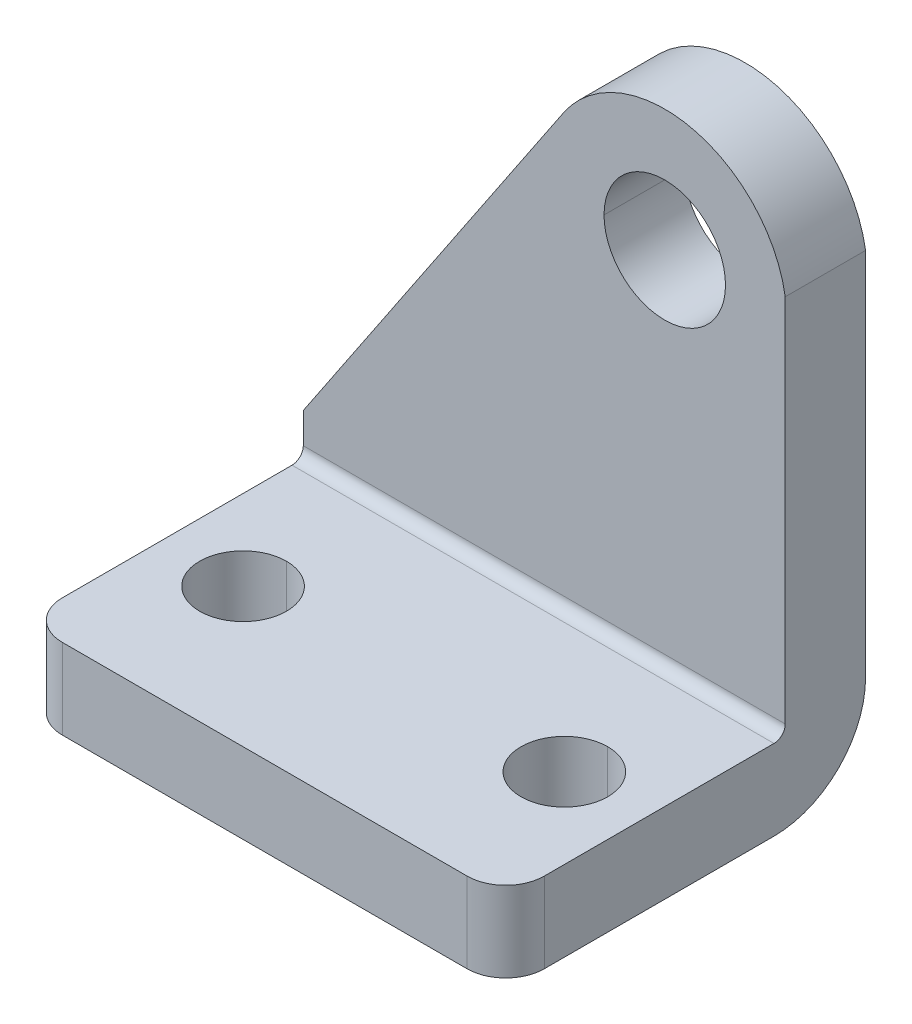
ISO-10303-21;
HEADER;
FILE_DESCRIPTION(('STEP AP214'),'2;1');
FILE_NAME('part.step','',(''),(''),'','','');
FILE_SCHEMA(('AUTOMOTIVE_DESIGN { 1 0 10303 214 1 1 1 1 }'));
ENDSEC;
DATA;
#1=APPLICATION_CONTEXT('core data for automotive mechanical design processes');
#2=APPLICATION_PROTOCOL_DEFINITION('international standard','automotive_design',2000,#1);
#3=PRODUCT_CONTEXT('',#1,'mechanical');
#4=PRODUCT('Part','Part','',(#3));
#5=PRODUCT_RELATED_PRODUCT_CATEGORY('part','',(#4));
#6=PRODUCT_DEFINITION_FORMATION('','',#4);
#7=PRODUCT_DEFINITION_CONTEXT('part definition',#1,'design');
#8=PRODUCT_DEFINITION('design','',#6,#7);
#9=PRODUCT_DEFINITION_SHAPE('','',#8);
#10=(LENGTH_UNIT() NAMED_UNIT(*) SI_UNIT(.MILLI.,.METRE.));
#11=(NAMED_UNIT(*) PLANE_ANGLE_UNIT() SI_UNIT($,.RADIAN.));
#12=(NAMED_UNIT(*) SI_UNIT($,.STERADIAN.) SOLID_ANGLE_UNIT());
#13=UNCERTAINTY_MEASURE_WITH_UNIT(LENGTH_MEASURE(1.E-05),#10,'distance_accuracy_value','');
#14=(GEOMETRIC_REPRESENTATION_CONTEXT(3) GLOBAL_UNCERTAINTY_ASSIGNED_CONTEXT((#13)) GLOBAL_UNIT_ASSIGNED_CONTEXT((#10,
#11,#12)) REPRESENTATION_CONTEXT('',''));
#15=CARTESIAN_POINT('',(0.,0.,0.));
#16=DIRECTION('',(0.,0.,1.));
#17=DIRECTION('',(1.,0.,0.));
#18=AXIS2_PLACEMENT_3D('',#15,#16,#17);
#19=CARTESIAN_POINT('',(35.0520000000013,6.35,25.4000000000013));
#20=DIRECTION('',(0.,1.,0.));
#21=DIRECTION('',(-0.707106781186546,0.,-0.707106781186549));
#22=AXIS2_PLACEMENT_3D('',#19,#20,#21);
#23=CYLINDRICAL_SURFACE('',#22,3.048);
#24=CARTESIAN_POINT('',(35.0520000000013,0.,25.4000000000013));
#25=DIRECTION('',(0.,1.,0.));
#26=DIRECTION('',(1.,0.,0.));
#27=AXIS2_PLACEMENT_3D('',#24,#25,#26);
#28=CIRCLE('',#27,3.048);
#29=CARTESIAN_POINT('',(35.052,0.,28.448));
#30=VERTEX_POINT('',#29);
#31=CARTESIAN_POINT('',(38.1,0.,25.4000000000013));
#32=VERTEX_POINT('',#31);
#33=EDGE_CURVE('E10',#30,#32,#28,.T.);
#34=ORIENTED_EDGE('',*,*,#33,.T.);
#35=DIRECTION('',(0.,-1.,0.));
#36=VECTOR('',#35,1.);
#37=CARTESIAN_POINT('',(38.1,6.35,25.4));
#38=LINE('',#37,#36);
#39=CARTESIAN_POINT('',(38.1,6.35,25.4));
#40=VERTEX_POINT('',#39);
#41=EDGE_CURVE('E24',#40,#32,#38,.T.);
#42=ORIENTED_EDGE('',*,*,#41,.F.);
#43=CARTESIAN_POINT('',(35.0520000000013,6.35,25.4000000000013));
#44=DIRECTION('',(0.,1.,0.));
#45=DIRECTION('',(1.,0.,0.));
#46=AXIS2_PLACEMENT_3D('',#43,#44,#45);
#47=CIRCLE('',#46,3.048);
#48=CARTESIAN_POINT('',(35.052,6.35,28.448));
#49=VERTEX_POINT('',#48);
#50=EDGE_CURVE('E339',#49,#40,#47,.T.);
#51=ORIENTED_EDGE('',*,*,#50,.F.);
#52=DIRECTION('',(0.,-1.,0.));
#53=VECTOR('',#52,1.);
#54=CARTESIAN_POINT('',(35.052,6.35,28.448));
#55=LINE('',#54,#53);
#56=EDGE_CURVE('E335',#49,#30,#55,.T.);
#57=ORIENTED_EDGE('',*,*,#56,.T.);
#58=EDGE_LOOP('',(#34,#42,#51,#57));
#59=FACE_BOUND('',#58,.T.);
#60=ADVANCED_FACE('F16',(#59),#23,.T.);
#61=CARTESIAN_POINT('',(38.1,6.35,28.448));
#62=DIRECTION('',(0.,0.,-1.));
#63=DIRECTION('',(-1.,0.,0.));
#64=AXIS2_PLACEMENT_3D('',#61,#62,#63);
#65=PLANE('',#64);
#66=DIRECTION('',(-1.,0.,0.));
#67=VECTOR('',#66,1.);
#68=CARTESIAN_POINT('',(38.1,0.,28.448));
#69=LINE('',#68,#67);
#70=CARTESIAN_POINT('',(3.048,0.,28.448));
#71=VERTEX_POINT('',#70);
#72=EDGE_CURVE('E330',#30,#71,#69,.T.);
#73=ORIENTED_EDGE('',*,*,#72,.F.);
#74=ORIENTED_EDGE('',*,*,#56,.F.);
#75=DIRECTION('',(-1.,0.,0.));
#76=VECTOR('',#75,1.);
#77=CARTESIAN_POINT('',(38.1,6.35,28.448));
#78=LINE('',#77,#76);
#79=CARTESIAN_POINT('',(3.048,6.35,28.448));
#80=VERTEX_POINT('',#79);
#81=EDGE_CURVE('E326',#49,#80,#78,.T.);
#82=ORIENTED_EDGE('',*,*,#81,.T.);
#83=DIRECTION('',(0.,-1.,0.));
#84=VECTOR('',#83,1.);
#85=CARTESIAN_POINT('',(3.048,6.35,28.448));
#86=LINE('',#85,#84);
#87=EDGE_CURVE('E322',#80,#71,#86,.T.);
#88=ORIENTED_EDGE('',*,*,#87,.T.);
#89=EDGE_LOOP('',(#73,#74,#82,#88));
#90=FACE_BOUND('',#89,.T.);
#91=ADVANCED_FACE('F421',(#90),#65,.F.);
#92=CARTESIAN_POINT('',(3.04799999999929,6.35,25.4000000000008));
#93=DIRECTION('',(0.,1.,0.));
#94=DIRECTION('',(0.707106781186553,0.,-0.707106781186542));
#95=AXIS2_PLACEMENT_3D('',#92,#93,#94);
#96=CYLINDRICAL_SURFACE('',#95,3.048);
#97=CARTESIAN_POINT('',(3.04799999999929,0.,25.4000000000008));
#98=DIRECTION('',(0.,1.,0.));
#99=DIRECTION('',(1.,0.,0.));
#100=AXIS2_PLACEMENT_3D('',#97,#98,#99);
#101=CIRCLE('',#100,3.048);
#102=CARTESIAN_POINT('',(0.,0.,25.4000000000008));
#103=VERTEX_POINT('',#102);
#104=EDGE_CURVE('E317',#103,#71,#101,.T.);
#105=ORIENTED_EDGE('',*,*,#104,.T.);
#106=ORIENTED_EDGE('',*,*,#87,.F.);
#107=CARTESIAN_POINT('',(3.04799999999929,6.35,25.4000000000008));
#108=DIRECTION('',(0.,1.,0.));
#109=DIRECTION('',(1.,0.,0.));
#110=AXIS2_PLACEMENT_3D('',#107,#108,#109);
#111=CIRCLE('',#110,3.048);
#112=CARTESIAN_POINT('',(0.,6.35,25.4));
#113=VERTEX_POINT('',#112);
#114=EDGE_CURVE('E312',#113,#80,#111,.T.);
#115=ORIENTED_EDGE('',*,*,#114,.F.);
#116=DIRECTION('',(0.,-1.,0.));
#117=VECTOR('',#116,1.);
#118=CARTESIAN_POINT('',(0.,6.35,25.4));
#119=LINE('',#118,#117);
#120=EDGE_CURVE('E308',#113,#103,#119,.T.);
#121=ORIENTED_EDGE('',*,*,#120,.T.);
#122=EDGE_LOOP('',(#105,#106,#115,#121));
#123=FACE_BOUND('',#122,.T.);
#124=ADVANCED_FACE('F418',(#123),#96,.T.);
#125=CARTESIAN_POINT('',(0.,7.23900000000005,7.23900000000005));
#126=DIRECTION('',(1.,0.,0.));
#127=DIRECTION('',(0.,0.,-1.));
#128=AXIS2_PLACEMENT_3D('',#125,#126,#127);
#129=PLANE('',#128);
#130=DIRECTION('',(0.,1.,0.));
#131=VECTOR('',#130,1.);
#132=CARTESIAN_POINT('',(0.,7.239,0.));
#133=LINE('',#132,#131);
#134=CARTESIAN_POINT('',(0.,7.239,0.));
#135=VERTEX_POINT('',#134);
#136=CARTESIAN_POINT('',(0.,9.652,0.));
#137=VERTEX_POINT('',#136);
#138=EDGE_CURVE('E303',#135,#137,#133,.T.);
#139=ORIENTED_EDGE('',*,*,#138,.F.);
#140=CARTESIAN_POINT('',(0.,7.23900000000005,7.23900000000005));
#141=DIRECTION('',(1.,0.,0.));
#142=DIRECTION('',(0.,0.,-1.));
#143=AXIS2_PLACEMENT_3D('',#140,#141,#142);
#144=CIRCLE('',#143,7.239);
#145=CARTESIAN_POINT('',(0.,0.,7.239));
#146=VERTEX_POINT('',#145);
#147=EDGE_CURVE('E298',#146,#135,#144,.T.);
#148=ORIENTED_EDGE('',*,*,#147,.F.);
#149=DIRECTION('',(0.,0.,-1.));
#150=VECTOR('',#149,1.);
#151=CARTESIAN_POINT('',(0.,0.,28.448));
#152=LINE('',#151,#150);
#153=EDGE_CURVE('E293',#103,#146,#152,.T.);
#154=ORIENTED_EDGE('',*,*,#153,.F.);
#155=ORIENTED_EDGE('',*,*,#120,.F.);
#156=DIRECTION('',(0.,0.,1.));
#157=VECTOR('',#156,1.);
#158=CARTESIAN_POINT('',(0.,6.35,7.239));
#159=LINE('',#158,#157);
#160=CARTESIAN_POINT('',(0.,6.35,7.239));
#161=VERTEX_POINT('',#160);
#162=EDGE_CURVE('E288',#161,#113,#159,.T.);
#163=ORIENTED_EDGE('',*,*,#162,.F.);
#164=CARTESIAN_POINT('',(0.,7.23900000000015,7.23900000000015));
#165=DIRECTION('',(1.,0.,0.));
#166=DIRECTION('',(0.,0.,-1.));
#167=AXIS2_PLACEMENT_3D('',#164,#165,#166);
#168=CIRCLE('',#167,0.889);
#169=CARTESIAN_POINT('',(0.,7.239,6.35));
#170=VERTEX_POINT('',#169);
#171=EDGE_CURVE('E284',#161,#170,#168,.T.);
#172=ORIENTED_EDGE('',*,*,#171,.T.);
#173=DIRECTION('',(0.,-1.,0.));
#174=VECTOR('',#173,1.);
#175=CARTESIAN_POINT('',(0.,45.72,6.35));
#176=LINE('',#175,#174);
#177=CARTESIAN_POINT('',(0.,9.652,6.35));
#178=VERTEX_POINT('',#177);
#179=EDGE_CURVE('E279',#178,#170,#176,.T.);
#180=ORIENTED_EDGE('',*,*,#179,.F.);
#181=DIRECTION('',(0.,0.,-1.));
#182=VECTOR('',#181,1.);
#183=CARTESIAN_POINT('',(0.,9.652,6.35));
#184=LINE('',#183,#182);
#185=EDGE_CURVE('E275',#178,#137,#184,.T.);
#186=ORIENTED_EDGE('',*,*,#185,.T.);
#187=EDGE_LOOP('',(#139,#148,#154,#155,#163,#172,#180,#186));
#188=FACE_BOUND('',#187,.T.);
#189=ADVANCED_FACE('F413',(#188),#129,.F.);
#190=CARTESIAN_POINT('',(0.,9.652,6.35));
#191=DIRECTION('',(-0.830469726300041,0.557063760891996,0.));
#192=DIRECTION('',(-0.557063760891996,-0.830469726300041,0.));
#193=AXIS2_PLACEMENT_3D('',#190,#191,#192);
#194=PLANE('',#193);
#195=DIRECTION('',(0.557063760891996,0.830469726300041,0.));
#196=VECTOR('',#195,1.);
#197=CARTESIAN_POINT('',(0.,9.652,0.));
#198=LINE('',#197,#196);
#199=CARTESIAN_POINT('',(20.559306201752,40.3017794201301,0.));
#200=VERTEX_POINT('',#199);
#201=EDGE_CURVE('E270',#137,#200,#198,.T.);
#202=ORIENTED_EDGE('',*,*,#201,.F.);
#203=ORIENTED_EDGE('',*,*,#185,.F.);
#204=DIRECTION('',(0.557063760891996,0.830469726300041,0.));
#205=VECTOR('',#204,1.);
#206=CARTESIAN_POINT('',(0.,9.652,6.35));
#207=LINE('',#206,#205);
#208=CARTESIAN_POINT('',(20.559306201752,40.3017794201301,6.35));
#209=VERTEX_POINT('',#208);
#210=EDGE_CURVE('E266',#178,#209,#207,.T.);
#211=ORIENTED_EDGE('',*,*,#210,.T.);
#212=DIRECTION('',(0.,0.,-1.));
#213=VECTOR('',#212,1.);
#214=CARTESIAN_POINT('',(20.559306201752,40.3017794201301,6.35));
#215=LINE('',#214,#213);
#216=EDGE_CURVE('E262',#209,#200,#215,.T.);
#217=ORIENTED_EDGE('',*,*,#216,.T.);
#218=EDGE_LOOP('',(#202,#203,#211,#217));
#219=FACE_BOUND('',#218,.T.);
#220=ADVANCED_FACE('F411',(#219),#194,.T.);
#221=CARTESIAN_POINT('',(28.5749999999997,34.9249999999997,6.35));
#222=DIRECTION('',(0.,0.,1.));
#223=DIRECTION('',(-0.212588316482745,-0.977141856485041,0.));
#224=AXIS2_PLACEMENT_3D('',#221,#222,#223);
#225=CYLINDRICAL_SURFACE('',#224,9.652);
#226=DIRECTION('',(0.,0.,-1.));
#227=VECTOR('',#226,1.);
#228=CARTESIAN_POINT('',(38.1,36.4856021273851,6.35));
#229=LINE('',#228,#227);
#230=CARTESIAN_POINT('',(38.1,36.4856021273851,6.35));
#231=VERTEX_POINT('',#230);
#232=CARTESIAN_POINT('',(38.1,36.4856021273851,0.));
#233=VERTEX_POINT('',#232);
#234=EDGE_CURVE('E258',#231,#233,#229,.T.);
#235=ORIENTED_EDGE('',*,*,#234,.T.);
#236=CARTESIAN_POINT('',(28.5749999999997,34.9249999999997,0.));
#237=DIRECTION('',(0.,0.,1.));
#238=DIRECTION('',(1.,0.,0.));
#239=AXIS2_PLACEMENT_3D('',#236,#237,#238);
#240=CIRCLE('',#239,9.652);
#241=EDGE_CURVE('E253',#233,#200,#240,.T.);
#242=ORIENTED_EDGE('',*,*,#241,.T.);
#243=ORIENTED_EDGE('',*,*,#216,.F.);
#244=CARTESIAN_POINT('',(28.5749999999997,34.9249999999997,6.35));
#245=DIRECTION('',(0.,0.,1.));
#246=DIRECTION('',(1.,0.,0.));
#247=AXIS2_PLACEMENT_3D('',#244,#245,#246);
#248=CIRCLE('',#247,9.652);
#249=EDGE_CURVE('E248',#231,#209,#248,.T.);
#250=ORIENTED_EDGE('',*,*,#249,.F.);
#251=EDGE_LOOP('',(#235,#242,#243,#250));
#252=FACE_BOUND('',#251,.T.);
#253=ADVANCED_FACE('F369',(#252),#225,.T.);
#254=CARTESIAN_POINT('',(38.1,45.72,6.35));
#255=DIRECTION('',(0.,0.,-1.));
#256=DIRECTION('',(-1.,0.,0.));
#257=AXIS2_PLACEMENT_3D('',#254,#255,#256);
#258=PLANE('',#257);
#259=CARTESIAN_POINT('',(28.575,34.925,6.35));
#260=DIRECTION('',(0.,0.,-1.));
#261=DIRECTION('',(-1.,0.,0.));
#262=AXIS2_PLACEMENT_3D('',#259,#260,#261);
#263=CIRCLE('',#262,4.8006);
#264=CARTESIAN_POINT('',(23.7744,34.925,6.35));
#265=VERTEX_POINT('',#264);
#266=CARTESIAN_POINT('',(33.3756,34.925,6.35));
#267=VERTEX_POINT('',#266);
#268=EDGE_CURVE('E244',#265,#267,#263,.T.);
#269=ORIENTED_EDGE('',*,*,#268,.T.);
#270=CARTESIAN_POINT('',(28.575,34.925,6.35));
#271=DIRECTION('',(0.,0.,-1.));
#272=DIRECTION('',(-1.,0.,0.));
#273=AXIS2_PLACEMENT_3D('',#270,#271,#272);
#274=CIRCLE('',#273,4.8006);
#275=EDGE_CURVE('E240',#267,#265,#274,.T.);
#276=ORIENTED_EDGE('',*,*,#275,.T.);
#277=EDGE_LOOP('',(#269,#276));
#278=FACE_BOUND('',#277,.T.);
#279=ORIENTED_EDGE('',*,*,#210,.F.);
#280=ORIENTED_EDGE('',*,*,#179,.T.);
#281=DIRECTION('',(-1.,0.,0.));
#282=VECTOR('',#281,1.);
#283=CARTESIAN_POINT('',(38.1,7.239,6.35));
#284=LINE('',#283,#282);
#285=CARTESIAN_POINT('',(38.1,7.239,6.35));
#286=VERTEX_POINT('',#285);
#287=EDGE_CURVE('E235',#286,#170,#284,.T.);
#288=ORIENTED_EDGE('',*,*,#287,.F.);
#289=DIRECTION('',(0.,-1.,0.));
#290=VECTOR('',#289,1.);
#291=CARTESIAN_POINT('',(38.1,45.72,6.35));
#292=LINE('',#291,#290);
#293=EDGE_CURVE('E230',#231,#286,#292,.T.);
#294=ORIENTED_EDGE('',*,*,#293,.F.);
#295=ORIENTED_EDGE('',*,*,#249,.T.);
#296=EDGE_LOOP('',(#279,#280,#288,#294,#295));
#297=FACE_BOUND('',#296,.T.);
#298=ADVANCED_FACE('F405',(#278,#297),#258,.F.);
#299=CARTESIAN_POINT('',(38.1,7.23900000000005,7.23900000000005));
#300=DIRECTION('',(1.,0.,0.));
#301=DIRECTION('',(0.,0.,-1.));
#302=AXIS2_PLACEMENT_3D('',#299,#300,#301);
#303=PLANE('',#302);
#304=CARTESIAN_POINT('',(38.1,7.23900000000015,7.23900000000015));
#305=DIRECTION('',(1.,0.,0.));
#306=DIRECTION('',(0.,0.,-1.));
#307=AXIS2_PLACEMENT_3D('',#304,#305,#306);
#308=CIRCLE('',#307,0.889);
#309=CARTESIAN_POINT('',(38.1,6.35,7.239));
#310=VERTEX_POINT('',#309);
#311=EDGE_CURVE('E225',#310,#286,#308,.T.);
#312=ORIENTED_EDGE('',*,*,#311,.F.);
#313=DIRECTION('',(0.,0.,1.));
#314=VECTOR('',#313,1.);
#315=CARTESIAN_POINT('',(38.1,6.35,7.239));
#316=LINE('',#315,#314);
#317=EDGE_CURVE('E221',#310,#40,#316,.T.);
#318=ORIENTED_EDGE('',*,*,#317,.T.);
#319=ORIENTED_EDGE('',*,*,#41,.T.);
#320=DIRECTION('',(0.,0.,-1.));
#321=VECTOR('',#320,1.);
#322=CARTESIAN_POINT('',(38.1,0.,28.448));
#323=LINE('',#322,#321);
#324=CARTESIAN_POINT('',(38.1,0.,7.239));
#325=VERTEX_POINT('',#324);
#326=EDGE_CURVE('E217',#32,#325,#323,.T.);
#327=ORIENTED_EDGE('',*,*,#326,.T.);
#328=CARTESIAN_POINT('',(38.1,7.23900000000005,7.23900000000005));
#329=DIRECTION('',(1.,0.,0.));
#330=DIRECTION('',(0.,0.,-1.));
#331=AXIS2_PLACEMENT_3D('',#328,#329,#330);
#332=CIRCLE('',#331,7.239);
#333=CARTESIAN_POINT('',(38.1,7.239,0.));
#334=VERTEX_POINT('',#333);
#335=EDGE_CURVE('E213',#325,#334,#332,.T.);
#336=ORIENTED_EDGE('',*,*,#335,.T.);
#337=DIRECTION('',(0.,1.,0.));
#338=VECTOR('',#337,1.);
#339=CARTESIAN_POINT('',(38.1,7.239,0.));
#340=LINE('',#339,#338);
#341=EDGE_CURVE('E208',#334,#233,#340,.T.);
#342=ORIENTED_EDGE('',*,*,#341,.T.);
#343=ORIENTED_EDGE('',*,*,#234,.F.);
#344=ORIENTED_EDGE('',*,*,#293,.T.);
#345=EDGE_LOOP('',(#312,#318,#319,#327,#336,#342,#343,#344));
#346=FACE_BOUND('',#345,.T.);
#347=ADVANCED_FACE('F350',(#346),#303,.T.);
#348=CARTESIAN_POINT('',(38.1,7.239,0.));
#349=DIRECTION('',(0.,0.,1.));
#350=DIRECTION('',(1.,0.,0.));
#351=AXIS2_PLACEMENT_3D('',#348,#349,#350);
#352=PLANE('',#351);
#353=CARTESIAN_POINT('',(28.575,34.925,0.));
#354=DIRECTION('',(0.,0.,-1.));
#355=DIRECTION('',(-1.,0.,0.));
#356=AXIS2_PLACEMENT_3D('',#353,#354,#355);
#357=CIRCLE('',#356,4.8006);
#358=CARTESIAN_POINT('',(23.7744,34.925,0.));
#359=VERTEX_POINT('',#358);
#360=CARTESIAN_POINT('',(33.3756,34.925,0.));
#361=VERTEX_POINT('',#360);
#362=EDGE_CURVE('E203',#359,#361,#357,.T.);
#363=ORIENTED_EDGE('',*,*,#362,.F.);
#364=CARTESIAN_POINT('',(28.575,34.925,0.));
#365=DIRECTION('',(0.,0.,-1.));
#366=DIRECTION('',(-1.,0.,0.));
#367=AXIS2_PLACEMENT_3D('',#364,#365,#366);
#368=CIRCLE('',#367,4.8006);
#369=EDGE_CURVE('E198',#361,#359,#368,.T.);
#370=ORIENTED_EDGE('',*,*,#369,.F.);
#371=EDGE_LOOP('',(#363,#370));
#372=FACE_BOUND('',#371,.T.);
#373=ORIENTED_EDGE('',*,*,#201,.T.);
#374=ORIENTED_EDGE('',*,*,#241,.F.);
#375=ORIENTED_EDGE('',*,*,#341,.F.);
#376=DIRECTION('',(-1.,0.,0.));
#377=VECTOR('',#376,1.);
#378=CARTESIAN_POINT('',(38.1,7.239,0.));
#379=LINE('',#378,#377);
#380=EDGE_CURVE('E193',#334,#135,#379,.T.);
#381=ORIENTED_EDGE('',*,*,#380,.T.);
#382=ORIENTED_EDGE('',*,*,#138,.T.);
#383=EDGE_LOOP('',(#373,#374,#375,#381,#382));
#384=FACE_BOUND('',#383,.T.);
#385=ADVANCED_FACE('F365',(#372,#384),#352,.F.);
#386=CARTESIAN_POINT('',(38.1,7.23900000000005,7.23900000000005));
#387=DIRECTION('',(1.,0.,0.));
#388=DIRECTION('',(0.,0.707106781186545,0.70710678118655));
#389=AXIS2_PLACEMENT_3D('',#386,#387,#388);
#390=CYLINDRICAL_SURFACE('',#389,7.239);
#391=ORIENTED_EDGE('',*,*,#147,.T.);
#392=ORIENTED_EDGE('',*,*,#380,.F.);
#393=ORIENTED_EDGE('',*,*,#335,.F.);
#394=DIRECTION('',(-1.,0.,0.));
#395=VECTOR('',#394,1.);
#396=CARTESIAN_POINT('',(38.1,0.,7.239));
#397=LINE('',#396,#395);
#398=EDGE_CURVE('E188',#325,#146,#397,.T.);
#399=ORIENTED_EDGE('',*,*,#398,.T.);
#400=EDGE_LOOP('',(#391,#392,#393,#399));
#401=FACE_BOUND('',#400,.T.);
#402=ADVANCED_FACE('F359',(#401),#390,.T.);
#403=CARTESIAN_POINT('',(38.1,0.,28.448));
#404=DIRECTION('',(0.,1.,0.));
#405=DIRECTION('',(0.,0.,1.));
#406=AXIS2_PLACEMENT_3D('',#403,#404,#405);
#407=PLANE('',#406);
#408=CARTESIAN_POINT('',(6.35,0.,17.4625));
#409=DIRECTION('',(0.,1.,0.));
#410=DIRECTION('',(0.,0.,1.));
#411=AXIS2_PLACEMENT_3D('',#408,#409,#410);
#412=CIRCLE('',#411,3.429);
#413=CARTESIAN_POINT('',(6.35,0.,20.8915));
#414=VERTEX_POINT('',#413);
#415=CARTESIAN_POINT('',(6.35,0.,14.0335));
#416=VERTEX_POINT('',#415);
#417=EDGE_CURVE('E184',#414,#416,#412,.T.);
#418=ORIENTED_EDGE('',*,*,#417,.T.);
#419=CARTESIAN_POINT('',(6.35,0.,17.4625));
#420=DIRECTION('',(0.,1.,0.));
#421=DIRECTION('',(0.,0.,1.));
#422=AXIS2_PLACEMENT_3D('',#419,#420,#421);
#423=CIRCLE('',#422,3.429);
#424=EDGE_CURVE('E144',#416,#414,#423,.T.);
#425=ORIENTED_EDGE('',*,*,#424,.T.);
#426=EDGE_LOOP('',(#418,#425));
#427=FACE_BOUND('',#426,.T.);
#428=CARTESIAN_POINT('',(31.75,0.,17.4625));
#429=DIRECTION('',(0.,1.,0.));
#430=DIRECTION('',(0.,0.,1.));
#431=AXIS2_PLACEMENT_3D('',#428,#429,#430);
#432=CIRCLE('',#431,3.429);
#433=CARTESIAN_POINT('',(31.75,0.,20.8915));
#434=VERTEX_POINT('',#433);
#435=CARTESIAN_POINT('',(31.75,0.,14.0335));
#436=VERTEX_POINT('',#435);
#437=EDGE_CURVE('E177',#434,#436,#432,.T.);
#438=ORIENTED_EDGE('',*,*,#437,.T.);
#439=CARTESIAN_POINT('',(31.75,0.,17.4625));
#440=DIRECTION('',(0.,1.,0.));
#441=DIRECTION('',(0.,0.,1.));
#442=AXIS2_PLACEMENT_3D('',#439,#440,#441);
#443=CIRCLE('',#442,3.429);
#444=EDGE_CURVE('E173',#436,#434,#443,.T.);
#445=ORIENTED_EDGE('',*,*,#444,.T.);
#446=EDGE_LOOP('',(#438,#445));
#447=FACE_BOUND('',#446,.T.);
#448=ORIENTED_EDGE('',*,*,#326,.F.);
#449=ORIENTED_EDGE('',*,*,#33,.F.);
#450=ORIENTED_EDGE('',*,*,#72,.T.);
#451=ORIENTED_EDGE('',*,*,#104,.F.);
#452=ORIENTED_EDGE('',*,*,#153,.T.);
#453=ORIENTED_EDGE('',*,*,#398,.F.);
#454=EDGE_LOOP('',(#448,#449,#450,#451,#452,#453));
#455=FACE_BOUND('',#454,.T.);
#456=ADVANCED_FACE('F355',(#427,#447,#455),#407,.F.);
#457=CARTESIAN_POINT('',(31.75,6.35,17.4625));
#458=DIRECTION('',(0.,-1.,0.));
#459=DIRECTION('',(1.,0.,0.));
#460=AXIS2_PLACEMENT_3D('',#457,#458,#459);
#461=CYLINDRICAL_SURFACE('',#460,3.429);
#462=ORIENTED_EDGE('',*,*,#444,.F.);
#463=DIRECTION('',(0.,-1.,0.));
#464=VECTOR('',#463,1.);
#465=CARTESIAN_POINT('',(31.75,6.35,14.0335));
#466=LINE('',#465,#464);
#467=CARTESIAN_POINT('',(31.75,6.35,14.0335));
#468=VERTEX_POINT('',#467);
#469=EDGE_CURVE('E168',#468,#436,#466,.T.);
#470=ORIENTED_EDGE('',*,*,#469,.F.);
#471=CARTESIAN_POINT('',(31.75,6.35,17.4625));
#472=DIRECTION('',(0.,1.,0.));
#473=DIRECTION('',(0.,0.,1.));
#474=AXIS2_PLACEMENT_3D('',#471,#472,#473);
#475=CIRCLE('',#474,3.429);
#476=CARTESIAN_POINT('',(31.75,6.35,20.8915));
#477=VERTEX_POINT('',#476);
#478=EDGE_CURVE('E164',#468,#477,#475,.T.);
#479=ORIENTED_EDGE('',*,*,#478,.T.);
#480=DIRECTION('',(0.,-1.,0.));
#481=VECTOR('',#480,1.);
#482=CARTESIAN_POINT('',(31.75,6.35,20.8915));
#483=LINE('',#482,#481);
#484=EDGE_CURVE('E153',#477,#434,#483,.T.);
#485=ORIENTED_EDGE('',*,*,#484,.T.);
#486=EDGE_LOOP('',(#462,#470,#479,#485));
#487=FACE_BOUND('',#486,.T.);
#488=ADVANCED_FACE('F448',(#487),#461,.F.);
#489=CARTESIAN_POINT('',(31.75,6.35,17.4625));
#490=DIRECTION('',(0.,-1.,0.));
#491=DIRECTION('',(-1.,0.,0.));
#492=AXIS2_PLACEMENT_3D('',#489,#490,#491);
#493=CYLINDRICAL_SURFACE('',#492,3.429);
#494=CARTESIAN_POINT('',(31.75,6.35,17.4625));
#495=DIRECTION('',(0.,1.,0.));
#496=DIRECTION('',(0.,0.,1.));
#497=AXIS2_PLACEMENT_3D('',#494,#495,#496);
#498=CIRCLE('',#497,3.429);
#499=EDGE_CURVE('E150',#477,#468,#498,.T.);
#500=ORIENTED_EDGE('',*,*,#499,.T.);
#501=ORIENTED_EDGE('',*,*,#469,.T.);
#502=ORIENTED_EDGE('',*,*,#437,.F.);
#503=ORIENTED_EDGE('',*,*,#484,.F.);
#504=EDGE_LOOP('',(#500,#501,#502,#503));
#505=FACE_BOUND('',#504,.T.);
#506=ADVANCED_FACE('F452',(#505),#493,.F.);
#507=CARTESIAN_POINT('',(38.1,6.35,7.239));
#508=DIRECTION('',(0.,-1.,0.));
#509=DIRECTION('',(0.,0.,-1.));
#510=AXIS2_PLACEMENT_3D('',#507,#508,#509);
#511=PLANE('',#510);
#512=CARTESIAN_POINT('',(6.35,6.35,17.4625));
#513=DIRECTION('',(0.,1.,0.));
#514=DIRECTION('',(0.,0.,1.));
#515=AXIS2_PLACEMENT_3D('',#512,#513,#514);
#516=CIRCLE('',#515,3.429);
#517=CARTESIAN_POINT('',(6.35,6.35,20.8915));
#518=VERTEX_POINT('',#517);
#519=CARTESIAN_POINT('',(6.35,6.35,14.0335));
#520=VERTEX_POINT('',#519);
#521=EDGE_CURVE('E134',#518,#520,#516,.T.);
#522=ORIENTED_EDGE('',*,*,#521,.F.);
#523=CARTESIAN_POINT('',(6.35,6.35,17.4625));
#524=DIRECTION('',(0.,1.,0.));
#525=DIRECTION('',(0.,0.,1.));
#526=AXIS2_PLACEMENT_3D('',#523,#524,#525);
#527=CIRCLE('',#526,3.429);
#528=EDGE_CURVE('E129',#520,#518,#527,.T.);
#529=ORIENTED_EDGE('',*,*,#528,.F.);
#530=EDGE_LOOP('',(#522,#529));
#531=FACE_BOUND('',#530,.T.);
#532=ORIENTED_EDGE('',*,*,#499,.F.);
#533=ORIENTED_EDGE('',*,*,#478,.F.);
#534=EDGE_LOOP('',(#532,#533));
#535=FACE_BOUND('',#534,.T.);
#536=ORIENTED_EDGE('',*,*,#81,.F.);
#537=ORIENTED_EDGE('',*,*,#50,.T.);
#538=ORIENTED_EDGE('',*,*,#317,.F.);
#539=DIRECTION('',(-1.,0.,0.));
#540=VECTOR('',#539,1.);
#541=CARTESIAN_POINT('',(38.1,6.35,7.239));
#542=LINE('',#541,#540);
#543=EDGE_CURVE('E138',#310,#161,#542,.T.);
#544=ORIENTED_EDGE('',*,*,#543,.T.);
#545=ORIENTED_EDGE('',*,*,#162,.T.);
#546=ORIENTED_EDGE('',*,*,#114,.T.);
#547=EDGE_LOOP('',(#536,#537,#538,#544,#545,#546));
#548=FACE_BOUND('',#547,.T.);
#549=ADVANCED_FACE('F131',(#531,#535,#548),#511,.F.);
#550=CARTESIAN_POINT('',(38.1,7.23900000000015,7.23900000000015));
#551=DIRECTION('',(1.,0.,0.));
#552=DIRECTION('',(0.,0.707106781186487,0.707106781186608));
#553=AXIS2_PLACEMENT_3D('',#550,#551,#552);
#554=CYLINDRICAL_SURFACE('',#553,0.889);
#555=ORIENTED_EDGE('',*,*,#287,.T.);
#556=ORIENTED_EDGE('',*,*,#171,.F.);
#557=ORIENTED_EDGE('',*,*,#543,.F.);
#558=ORIENTED_EDGE('',*,*,#311,.T.);
#559=EDGE_LOOP('',(#555,#556,#557,#558));
#560=FACE_BOUND('',#559,.T.);
#561=ADVANCED_FACE('F374',(#560),#554,.F.);
#562=CARTESIAN_POINT('',(6.35,6.35,17.4625));
#563=DIRECTION('',(0.,-1.,0.));
#564=DIRECTION('',(1.,0.,0.));
#565=AXIS2_PLACEMENT_3D('',#562,#563,#564);
#566=CYLINDRICAL_SURFACE('',#565,3.429);
#567=ORIENTED_EDGE('',*,*,#424,.F.);
#568=DIRECTION('',(0.,-1.,0.));
#569=VECTOR('',#568,1.);
#570=CARTESIAN_POINT('',(6.35,6.35,14.0335));
#571=LINE('',#570,#569);
#572=EDGE_CURVE('E142',#520,#416,#571,.T.);
#573=ORIENTED_EDGE('',*,*,#572,.F.);
#574=ORIENTED_EDGE('',*,*,#528,.T.);
#575=DIRECTION('',(0.,-1.,0.));
#576=VECTOR('',#575,1.);
#577=CARTESIAN_POINT('',(6.35,6.35,20.8915));
#578=LINE('',#577,#576);
#579=EDGE_CURVE('E147',#518,#414,#578,.T.);
#580=ORIENTED_EDGE('',*,*,#579,.T.);
#581=EDGE_LOOP('',(#567,#573,#574,#580));
#582=FACE_BOUND('',#581,.T.);
#583=ADVANCED_FACE('F143',(#582),#566,.F.);
#584=CARTESIAN_POINT('',(6.35,6.35,17.4625));
#585=DIRECTION('',(0.,-1.,0.));
#586=DIRECTION('',(-1.,0.,0.));
#587=AXIS2_PLACEMENT_3D('',#584,#585,#586);
#588=CYLINDRICAL_SURFACE('',#587,3.429);
#589=ORIENTED_EDGE('',*,*,#521,.T.);
#590=ORIENTED_EDGE('',*,*,#572,.T.);
#591=ORIENTED_EDGE('',*,*,#417,.F.);
#592=ORIENTED_EDGE('',*,*,#579,.F.);
#593=EDGE_LOOP('',(#589,#590,#591,#592));
#594=FACE_BOUND('',#593,.T.);
#595=ADVANCED_FACE('F149',(#594),#588,.F.);
#596=CARTESIAN_POINT('',(28.575,34.925,0.));
#597=DIRECTION('',(0.,0.,1.));
#598=DIRECTION('',(0.,1.,0.));
#599=AXIS2_PLACEMENT_3D('',#596,#597,#598);
#600=CYLINDRICAL_SURFACE('',#599,4.8006);
#601=ORIENTED_EDGE('',*,*,#275,.F.);
#602=DIRECTION('',(0.,0.,1.));
#603=VECTOR('',#602,1.);
#604=CARTESIAN_POINT('',(33.3756,34.925,0.));
#605=LINE('',#604,#603);
#606=EDGE_CURVE('E387',#361,#267,#605,.T.);
#607=ORIENTED_EDGE('',*,*,#606,.F.);
#608=ORIENTED_EDGE('',*,*,#369,.T.);
#609=DIRECTION('',(0.,0.,1.));
#610=VECTOR('',#609,1.);
#611=CARTESIAN_POINT('',(23.7744,34.925,0.));
#612=LINE('',#611,#610);
#613=EDGE_CURVE('E392',#359,#265,#612,.T.);
#614=ORIENTED_EDGE('',*,*,#613,.T.);
#615=EDGE_LOOP('',(#601,#607,#608,#614));
#616=FACE_BOUND('',#615,.T.);
#617=ADVANCED_FACE('F400',(#616),#600,.F.);
#618=CARTESIAN_POINT('',(28.575,34.925,0.));
#619=DIRECTION('',(0.,0.,1.));
#620=DIRECTION('',(0.,-1.,0.));
#621=AXIS2_PLACEMENT_3D('',#618,#619,#620);
#622=CYLINDRICAL_SURFACE('',#621,4.8006);
#623=ORIENTED_EDGE('',*,*,#362,.T.);
#624=ORIENTED_EDGE('',*,*,#606,.T.);
#625=ORIENTED_EDGE('',*,*,#268,.F.);
#626=ORIENTED_EDGE('',*,*,#613,.F.);
#627=EDGE_LOOP('',(#623,#624,#625,#626));
#628=FACE_BOUND('',#627,.T.);
#629=ADVANCED_FACE('F403',(#628),#622,.F.);
#630=CLOSED_SHELL('',(#60,#91,#124,#189,#220,#253,#298,#347,#385,#402,#456,#488,#506,#549,#561,
#583,#595,#617,#629));
#631=MANIFOLD_SOLID_BREP('B1',#630);
#632=ADVANCED_BREP_SHAPE_REPRESENTATION('',(#18,#631),#14);
#633=SHAPE_DEFINITION_REPRESENTATION(#9,#632);
ENDSEC;
END-ISO-10303-21;
